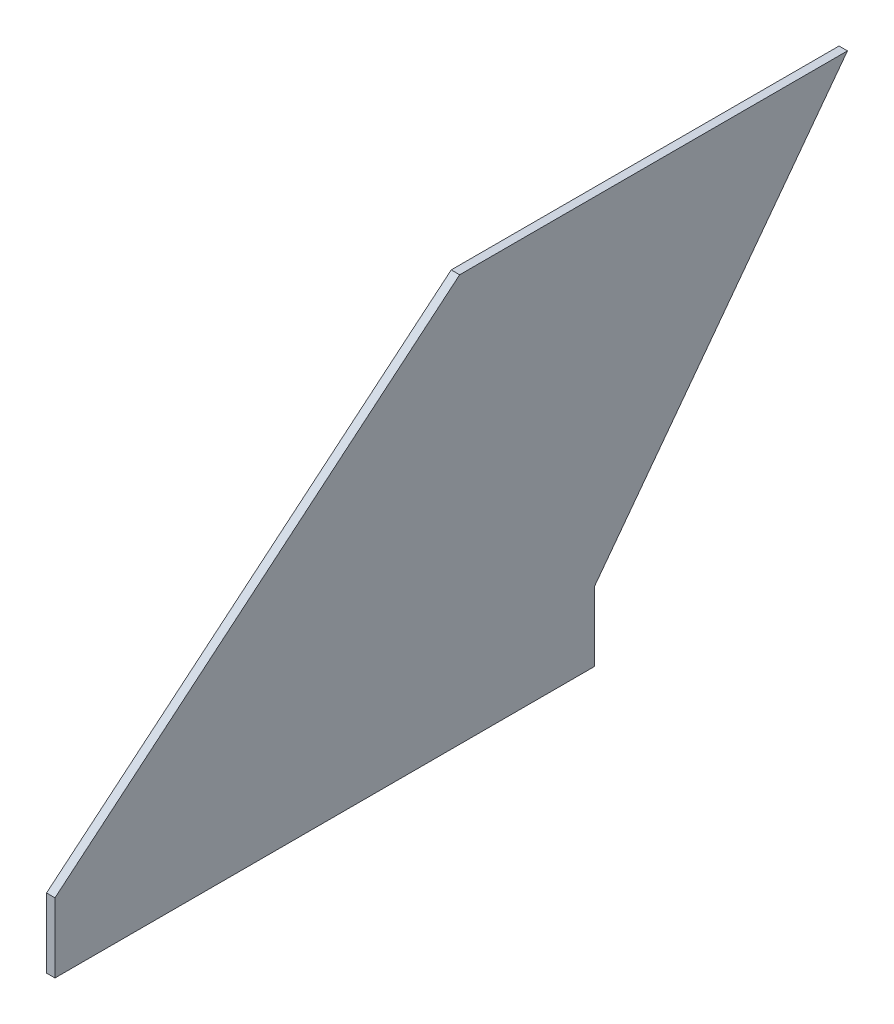
ISO-10303-21;
HEADER;
FILE_DESCRIPTION(('STEP AP214'),'2;1');
FILE_NAME('part.step','',(''),(''),'','','');
FILE_SCHEMA(('AUTOMOTIVE_DESIGN { 1 0 10303 214 1 1 1 1 }'));
ENDSEC;
DATA;
#1=APPLICATION_CONTEXT('core data for automotive mechanical design processes');
#2=APPLICATION_PROTOCOL_DEFINITION('international standard','automotive_design',2000,#1);
#3=PRODUCT_CONTEXT('',#1,'mechanical');
#4=PRODUCT('Part','Part','',(#3));
#5=PRODUCT_RELATED_PRODUCT_CATEGORY('part','',(#4));
#6=PRODUCT_DEFINITION_FORMATION('','',#4);
#7=PRODUCT_DEFINITION_CONTEXT('part definition',#1,'design');
#8=PRODUCT_DEFINITION('design','',#6,#7);
#9=PRODUCT_DEFINITION_SHAPE('','',#8);
#10=(LENGTH_UNIT() NAMED_UNIT(*) SI_UNIT(.MILLI.,.METRE.));
#11=(NAMED_UNIT(*) PLANE_ANGLE_UNIT() SI_UNIT($,.RADIAN.));
#12=(NAMED_UNIT(*) SI_UNIT($,.STERADIAN.) SOLID_ANGLE_UNIT());
#13=UNCERTAINTY_MEASURE_WITH_UNIT(LENGTH_MEASURE(1.E-05),#10,'distance_accuracy_value','');
#14=(GEOMETRIC_REPRESENTATION_CONTEXT(3) GLOBAL_UNCERTAINTY_ASSIGNED_CONTEXT((#13)) GLOBAL_UNIT_ASSIGNED_CONTEXT((#10,
#11,#12)) REPRESENTATION_CONTEXT('',''));
#15=CARTESIAN_POINT('',(0.,0.,0.));
#16=DIRECTION('',(0.,0.,1.));
#17=DIRECTION('',(1.,0.,0.));
#18=AXIS2_PLACEMENT_3D('',#15,#16,#17);
#19=CARTESIAN_POINT('',(3.175,127.,-298.45));
#20=DIRECTION('',(0.,0.6,0.8));
#21=DIRECTION('',(0.,-0.8,0.6));
#22=AXIS2_PLACEMENT_3D('',#19,#20,#21);
#23=PLANE('',#22);
#24=DIRECTION('',(0.,0.8,-0.6));
#25=VECTOR('',#24,1.);
#26=CARTESIAN_POINT('',(0.,127.,-298.45));
#27=LINE('',#26,#25);
#28=CARTESIAN_POINT('',(0.,0.,-203.2));
#29=VERTEX_POINT('',#28);
#30=CARTESIAN_POINT('',(0.,127.,-298.45));
#31=VERTEX_POINT('',#30);
#32=EDGE_CURVE('E131',#29,#31,#27,.T.);
#33=ORIENTED_EDGE('',*,*,#32,.T.);
#34=DIRECTION('',(-1.,0.,0.));
#35=VECTOR('',#34,1.);
#36=CARTESIAN_POINT('',(3.175,127.,-298.45));
#37=LINE('',#36,#35);
#38=CARTESIAN_POINT('',(3.175,127.,-298.45));
#39=VERTEX_POINT('',#38);
#40=EDGE_CURVE('E11',#39,#31,#37,.T.);
#41=ORIENTED_EDGE('',*,*,#40,.F.);
#42=DIRECTION('',(0.,0.8,-0.6));
#43=VECTOR('',#42,1.);
#44=CARTESIAN_POINT('',(3.175,127.,-298.45));
#45=LINE('',#44,#43);
#46=CARTESIAN_POINT('',(3.175,0.,-203.2));
#47=VERTEX_POINT('',#46);
#48=EDGE_CURVE('E147',#47,#39,#45,.T.);
#49=ORIENTED_EDGE('',*,*,#48,.F.);
#50=DIRECTION('',(-1.,0.,0.));
#51=VECTOR('',#50,1.);
#52=CARTESIAN_POINT('',(3.175,0.,-203.2));
#53=LINE('',#52,#51);
#54=EDGE_CURVE('E127',#47,#29,#53,.T.);
#55=ORIENTED_EDGE('',*,*,#54,.T.);
#56=EDGE_LOOP('',(#33,#41,#49,#55));
#57=FACE_BOUND('',#56,.T.);
#58=ADVANCED_FACE('F41',(#57),#23,.F.);
#59=CARTESIAN_POINT('',(3.175,127.,-152.4));
#60=DIRECTION('',(0.,-1.,0.));
#61=DIRECTION('',(0.,0.,-1.));
#62=AXIS2_PLACEMENT_3D('',#59,#60,#61);
#63=PLANE('',#62);
#64=DIRECTION('',(0.,0.,1.));
#65=VECTOR('',#64,1.);
#66=CARTESIAN_POINT('',(0.,127.,-152.4));
#67=LINE('',#66,#65);
#68=CARTESIAN_POINT('',(0.,127.,-152.4));
#69=VERTEX_POINT('',#68);
#70=EDGE_CURVE('E135',#31,#69,#67,.T.);
#71=ORIENTED_EDGE('',*,*,#70,.T.);
#72=DIRECTION('',(-1.,0.,0.));
#73=VECTOR('',#72,1.);
#74=CARTESIAN_POINT('',(3.175,127.,-152.4));
#75=LINE('',#74,#73);
#76=CARTESIAN_POINT('',(3.175,127.,-152.4));
#77=VERTEX_POINT('',#76);
#78=EDGE_CURVE('E50',#77,#69,#75,.T.);
#79=ORIENTED_EDGE('',*,*,#78,.F.);
#80=DIRECTION('',(0.,0.,1.));
#81=VECTOR('',#80,1.);
#82=CARTESIAN_POINT('',(3.175,127.,-152.4));
#83=LINE('',#82,#81);
#84=EDGE_CURVE('E95',#39,#77,#83,.T.);
#85=ORIENTED_EDGE('',*,*,#84,.F.);
#86=ORIENTED_EDGE('',*,*,#40,.T.);
#87=EDGE_LOOP('',(#71,#79,#85,#86));
#88=FACE_BOUND('',#87,.T.);
#89=ADVANCED_FACE('F176',(#88),#63,.F.);
#90=CARTESIAN_POINT('',(3.175,0.,0.));
#91=DIRECTION('',(0.,-0.768221279597376,-0.64018439966448));
#92=DIRECTION('',(0.,0.64018439966448,-0.768221279597376));
#93=AXIS2_PLACEMENT_3D('',#90,#91,#92);
#94=PLANE('',#93);
#95=DIRECTION('',(0.,-0.64018439966448,0.768221279597376));
#96=VECTOR('',#95,1.);
#97=CARTESIAN_POINT('',(0.,0.,0.));
#98=LINE('',#97,#96);
#99=CARTESIAN_POINT('',(0.,0.,0.));
#100=VERTEX_POINT('',#99);
#101=EDGE_CURVE('E138',#69,#100,#98,.T.);
#102=ORIENTED_EDGE('',*,*,#101,.T.);
#103=DIRECTION('',(-1.,0.,0.));
#104=VECTOR('',#103,1.);
#105=CARTESIAN_POINT('',(3.175,0.,0.));
#106=LINE('',#105,#104);
#107=CARTESIAN_POINT('',(3.175,0.,0.));
#108=VERTEX_POINT('',#107);
#109=EDGE_CURVE('E119',#108,#100,#106,.T.);
#110=ORIENTED_EDGE('',*,*,#109,.F.);
#111=DIRECTION('',(0.,-0.64018439966448,0.768221279597376));
#112=VECTOR('',#111,1.);
#113=CARTESIAN_POINT('',(3.175,0.,0.));
#114=LINE('',#113,#112);
#115=EDGE_CURVE('E108',#77,#108,#114,.T.);
#116=ORIENTED_EDGE('',*,*,#115,.F.);
#117=ORIENTED_EDGE('',*,*,#78,.T.);
#118=EDGE_LOOP('',(#102,#110,#116,#117));
#119=FACE_BOUND('',#118,.T.);
#120=ADVANCED_FACE('F158',(#119),#94,.F.);
#121=CARTESIAN_POINT('',(3.175,-26.1493,0.));
#122=DIRECTION('',(0.,0.,-1.));
#123=DIRECTION('',(-1.,0.,0.));
#124=AXIS2_PLACEMENT_3D('',#121,#122,#123);
#125=PLANE('',#124);
#126=DIRECTION('',(0.,-1.,0.));
#127=VECTOR('',#126,1.);
#128=CARTESIAN_POINT('',(0.,-26.1493,0.));
#129=LINE('',#128,#127);
#130=CARTESIAN_POINT('',(0.,-26.1493,0.));
#131=VERTEX_POINT('',#130);
#132=EDGE_CURVE('E117',#100,#131,#129,.T.);
#133=ORIENTED_EDGE('',*,*,#132,.T.);
#134=DIRECTION('',(-1.,0.,0.));
#135=VECTOR('',#134,1.);
#136=CARTESIAN_POINT('',(3.175,-26.1493,0.));
#137=LINE('',#136,#135);
#138=CARTESIAN_POINT('',(3.175,-26.1493,0.));
#139=VERTEX_POINT('',#138);
#140=EDGE_CURVE('E114',#139,#131,#137,.T.);
#141=ORIENTED_EDGE('',*,*,#140,.F.);
#142=DIRECTION('',(0.,-1.,0.));
#143=VECTOR('',#142,1.);
#144=CARTESIAN_POINT('',(3.175,-26.1493,0.));
#145=LINE('',#144,#143);
#146=EDGE_CURVE('E102',#108,#139,#145,.T.);
#147=ORIENTED_EDGE('',*,*,#146,.F.);
#148=ORIENTED_EDGE('',*,*,#109,.T.);
#149=EDGE_LOOP('',(#133,#141,#147,#148));
#150=FACE_BOUND('',#149,.T.);
#151=ADVANCED_FACE('F115',(#150),#125,.F.);
#152=CARTESIAN_POINT('',(3.175,-26.1493,0.));
#153=DIRECTION('',(0.,1.,0.));
#154=DIRECTION('',(0.,0.,1.));
#155=AXIS2_PLACEMENT_3D('',#152,#153,#154);
#156=PLANE('',#155);
#157=DIRECTION('',(0.,0.,-1.));
#158=VECTOR('',#157,1.);
#159=CARTESIAN_POINT('',(0.,-26.1493,0.));
#160=LINE('',#159,#158);
#161=CARTESIAN_POINT('',(0.,-26.1493,-203.2));
#162=VERTEX_POINT('',#161);
#163=EDGE_CURVE('E81',#131,#162,#160,.T.);
#164=ORIENTED_EDGE('',*,*,#163,.T.);
#165=DIRECTION('',(-1.,0.,0.));
#166=VECTOR('',#165,1.);
#167=CARTESIAN_POINT('',(3.175,-26.1493,-203.2));
#168=LINE('',#167,#166);
#169=CARTESIAN_POINT('',(3.175,-26.1493,-203.2));
#170=VERTEX_POINT('',#169);
#171=EDGE_CURVE('E120',#170,#162,#168,.T.);
#172=ORIENTED_EDGE('',*,*,#171,.F.);
#173=DIRECTION('',(0.,0.,-1.));
#174=VECTOR('',#173,1.);
#175=CARTESIAN_POINT('',(3.175,-26.1493,0.));
#176=LINE('',#175,#174);
#177=EDGE_CURVE('E106',#139,#170,#176,.T.);
#178=ORIENTED_EDGE('',*,*,#177,.F.);
#179=ORIENTED_EDGE('',*,*,#140,.T.);
#180=EDGE_LOOP('',(#164,#172,#178,#179));
#181=FACE_BOUND('',#180,.T.);
#182=ADVANCED_FACE('F122',(#181),#156,.F.);
#183=CARTESIAN_POINT('',(3.175,-26.1493,-203.2));
#184=DIRECTION('',(0.,0.,1.));
#185=DIRECTION('',(1.,0.,0.));
#186=AXIS2_PLACEMENT_3D('',#183,#184,#185);
#187=PLANE('',#186);
#188=DIRECTION('',(0.,1.,0.));
#189=VECTOR('',#188,1.);
#190=CARTESIAN_POINT('',(0.,-26.1493,-203.2));
#191=LINE('',#190,#189);
#192=EDGE_CURVE('E87',#162,#29,#191,.T.);
#193=ORIENTED_EDGE('',*,*,#192,.T.);
#194=ORIENTED_EDGE('',*,*,#54,.F.);
#195=DIRECTION('',(0.,1.,0.));
#196=VECTOR('',#195,1.);
#197=CARTESIAN_POINT('',(3.175,-26.1493,-203.2));
#198=LINE('',#197,#196);
#199=EDGE_CURVE('E58',#170,#47,#198,.T.);
#200=ORIENTED_EDGE('',*,*,#199,.F.);
#201=ORIENTED_EDGE('',*,*,#171,.T.);
#202=EDGE_LOOP('',(#193,#194,#200,#201));
#203=FACE_BOUND('',#202,.T.);
#204=ADVANCED_FACE('F165',(#203),#187,.F.);
#205=CARTESIAN_POINT('',(3.175,0.,0.));
#206=DIRECTION('',(1.,0.,0.));
#207=DIRECTION('',(0.,0.,-1.));
#208=AXIS2_PLACEMENT_3D('',#205,#206,#207);
#209=PLANE('',#208);
#210=ORIENTED_EDGE('',*,*,#48,.T.);
#211=ORIENTED_EDGE('',*,*,#84,.T.);
#212=ORIENTED_EDGE('',*,*,#115,.T.);
#213=ORIENTED_EDGE('',*,*,#146,.T.);
#214=ORIENTED_EDGE('',*,*,#177,.T.);
#215=ORIENTED_EDGE('',*,*,#199,.T.);
#216=EDGE_LOOP('',(#210,#211,#212,#213,#214,#215));
#217=FACE_BOUND('',#216,.T.);
#218=ADVANCED_FACE('F104',(#217),#209,.T.);
#219=CARTESIAN_POINT('',(0.,0.,0.));
#220=DIRECTION('',(1.,0.,0.));
#221=DIRECTION('',(0.,0.,-1.));
#222=AXIS2_PLACEMENT_3D('',#219,#220,#221);
#223=PLANE('',#222);
#224=ORIENTED_EDGE('',*,*,#32,.F.);
#225=ORIENTED_EDGE('',*,*,#192,.F.);
#226=ORIENTED_EDGE('',*,*,#163,.F.);
#227=ORIENTED_EDGE('',*,*,#132,.F.);
#228=ORIENTED_EDGE('',*,*,#101,.F.);
#229=ORIENTED_EDGE('',*,*,#70,.F.);
#230=EDGE_LOOP('',(#224,#225,#226,#227,#228,#229));
#231=FACE_BOUND('',#230,.T.);
#232=ADVANCED_FACE('F161',(#231),#223,.F.);
#233=CLOSED_SHELL('',(#58,#89,#120,#151,#182,#204,#218,#232));
#234=MANIFOLD_SOLID_BREP('B2',#233);
#235=ADVANCED_BREP_SHAPE_REPRESENTATION('',(#18,#234),#14);
#236=SHAPE_DEFINITION_REPRESENTATION(#9,#235);
ENDSEC;
END-ISO-10303-21;
